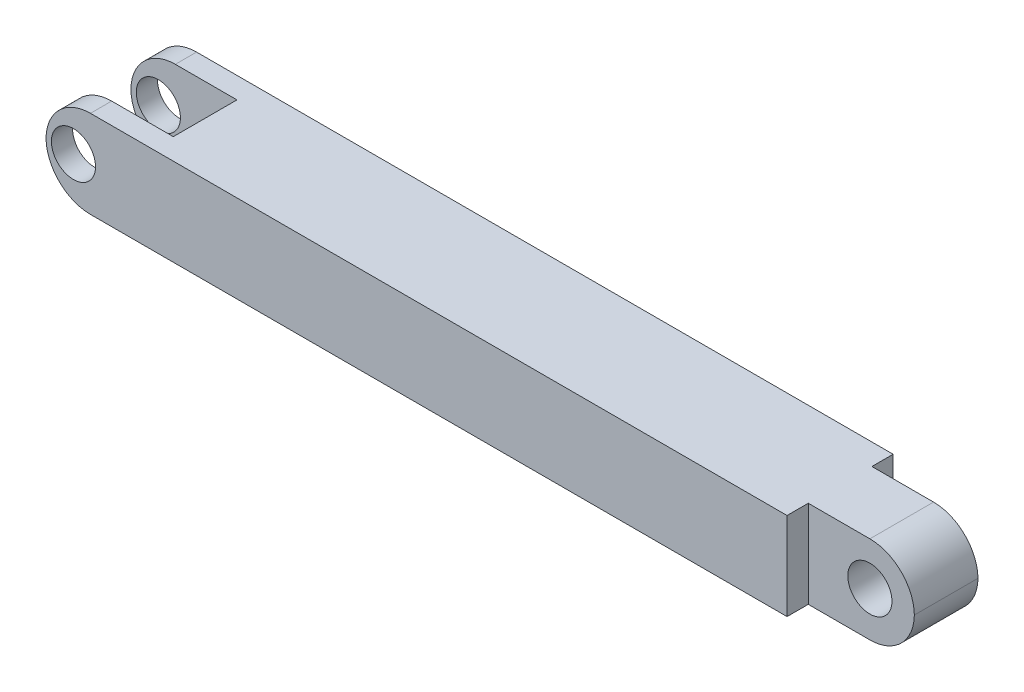
ISO-10303-21;
HEADER;
FILE_DESCRIPTION(('STEP AP214'),'2;1');
FILE_NAME('part.step','',(''),(''),'','','');
FILE_SCHEMA(('AUTOMOTIVE_DESIGN { 1 0 10303 214 1 1 1 1 }'));
ENDSEC;
DATA;
#1=APPLICATION_CONTEXT('core data for automotive mechanical design processes');
#2=APPLICATION_PROTOCOL_DEFINITION('international standard','automotive_design',2000,#1);
#3=PRODUCT_CONTEXT('',#1,'mechanical');
#4=PRODUCT('Part','Part','',(#3));
#5=PRODUCT_RELATED_PRODUCT_CATEGORY('part','',(#4));
#6=PRODUCT_DEFINITION_FORMATION('','',#4);
#7=PRODUCT_DEFINITION_CONTEXT('part definition',#1,'design');
#8=PRODUCT_DEFINITION('design','',#6,#7);
#9=PRODUCT_DEFINITION_SHAPE('','',#8);
#10=(LENGTH_UNIT() NAMED_UNIT(*) SI_UNIT(.MILLI.,.METRE.));
#11=(NAMED_UNIT(*) PLANE_ANGLE_UNIT() SI_UNIT($,.RADIAN.));
#12=(NAMED_UNIT(*) SI_UNIT($,.STERADIAN.) SOLID_ANGLE_UNIT());
#13=UNCERTAINTY_MEASURE_WITH_UNIT(LENGTH_MEASURE(1.E-05),#10,'distance_accuracy_value','');
#14=(GEOMETRIC_REPRESENTATION_CONTEXT(3) GLOBAL_UNCERTAINTY_ASSIGNED_CONTEXT((#13)) GLOBAL_UNIT_ASSIGNED_CONTEXT((#10,
#11,#12)) REPRESENTATION_CONTEXT('',''));
#15=CARTESIAN_POINT('',(0.,0.,0.));
#16=DIRECTION('',(0.,0.,1.));
#17=DIRECTION('',(1.,0.,0.));
#18=AXIS2_PLACEMENT_3D('',#15,#16,#17);
#19=CARTESIAN_POINT('',(69.85,8.255,0.));
#20=DIRECTION('',(1.,0.,0.));
#21=DIRECTION('',(0.,0.,-1.));
#22=AXIS2_PLACEMENT_3D('',#19,#20,#21);
#23=PLANE('',#22);
#24=DIRECTION('',(0.,0.,1.));
#25=VECTOR('',#24,1.);
#26=CARTESIAN_POINT('',(69.85,0.,0.));
#27=LINE('',#26,#25);
#28=CARTESIAN_POINT('',(69.85,0.,7.99998));
#29=VERTEX_POINT('',#28);
#30=CARTESIAN_POINT('',(69.85,0.,9.99998));
#31=VERTEX_POINT('',#30);
#32=EDGE_CURVE('E159',#29,#31,#27,.T.);
#33=ORIENTED_EDGE('',*,*,#32,.F.);
#34=DIRECTION('',(0.,-1.,0.));
#35=VECTOR('',#34,1.);
#36=CARTESIAN_POINT('',(69.85,8.255,7.99998));
#37=LINE('',#36,#35);
#38=CARTESIAN_POINT('',(69.85,8.255,7.99998));
#39=VERTEX_POINT('',#38);
#40=EDGE_CURVE('E147',#39,#29,#37,.T.);
#41=ORIENTED_EDGE('',*,*,#40,.F.);
#42=DIRECTION('',(0.,0.,1.));
#43=VECTOR('',#42,1.);
#44=CARTESIAN_POINT('',(69.85,8.255,0.));
#45=LINE('',#44,#43);
#46=CARTESIAN_POINT('',(69.85,8.255,9.99998));
#47=VERTEX_POINT('',#46);
#48=EDGE_CURVE('E153',#39,#47,#45,.T.);
#49=ORIENTED_EDGE('',*,*,#48,.T.);
#50=DIRECTION('',(0.,-1.,0.));
#51=VECTOR('',#50,1.);
#52=CARTESIAN_POINT('',(69.85,8.255,9.99998));
#53=LINE('',#52,#51);
#54=EDGE_CURVE('E189',#47,#31,#53,.T.);
#55=ORIENTED_EDGE('',*,*,#54,.T.);
#56=EDGE_LOOP('',(#33,#41,#49,#55));
#57=FACE_BOUND('',#56,.T.);
#58=ADVANCED_FACE('F35',(#57),#23,.T.);
#59=CARTESIAN_POINT('',(0.,8.255,7.99998000000001));
#60=DIRECTION('',(0.,0.,1.));
#61=DIRECTION('',(1.,0.,0.));
#62=AXIS2_PLACEMENT_3D('',#59,#60,#61);
#63=PLANE('',#62);
#64=CARTESIAN_POINT('',(75.65898,4.191,7.99998000000001));
#65=DIRECTION('',(0.,0.,1.));
#66=DIRECTION('',(1.,0.,0.));
#67=AXIS2_PLACEMENT_3D('',#64,#65,#66);
#68=CIRCLE('',#67,2.07899);
#69=CARTESIAN_POINT('',(77.73797,4.191,7.99998000000001));
#70=VERTEX_POINT('',#69);
#71=EDGE_CURVE('E265',#70,#70,#68,.T.);
#72=ORIENTED_EDGE('',*,*,#71,.F.);
#73=EDGE_LOOP('',(#72));
#74=FACE_BOUND('',#73,.T.);
#75=DIRECTION('',(-1.,0.,0.));
#76=VECTOR('',#75,1.);
#77=CARTESIAN_POINT('',(0.,0.,7.99998000000001));
#78=LINE('',#77,#76);
#79=CARTESIAN_POINT('',(75.65898,0.,7.99998));
#80=VERTEX_POINT('',#79);
#81=EDGE_CURVE('E191',#80,#29,#78,.T.);
#82=ORIENTED_EDGE('',*,*,#81,.F.);
#83=CARTESIAN_POINT('',(75.65898,4.191,7.99998));
#84=DIRECTION('',(0.,0.,1.));
#85=DIRECTION('',(1.,0.,0.));
#86=AXIS2_PLACEMENT_3D('',#83,#84,#85);
#87=CIRCLE('',#86,4.191);
#88=CARTESIAN_POINT('',(79.8494989117817,4.1275,7.99998));
#89=VERTEX_POINT('',#88);
#90=EDGE_CURVE('E253',#80,#89,#87,.T.);
#91=ORIENTED_EDGE('',*,*,#90,.T.);
#92=CARTESIAN_POINT('',(75.65898,4.064,7.99998));
#93=DIRECTION('',(0.,0.,1.));
#94=DIRECTION('',(1.,0.,0.));
#95=AXIS2_PLACEMENT_3D('',#92,#93,#94);
#96=CIRCLE('',#95,4.191);
#97=CARTESIAN_POINT('',(75.65898,8.255,7.99998));
#98=VERTEX_POINT('',#97);
#99=EDGE_CURVE('E150',#89,#98,#96,.T.);
#100=ORIENTED_EDGE('',*,*,#99,.T.);
#101=DIRECTION('',(-1.,0.,0.));
#102=VECTOR('',#101,1.);
#103=CARTESIAN_POINT('',(0.,8.255,7.99998000000001));
#104=LINE('',#103,#102);
#105=EDGE_CURVE('E143',#98,#39,#104,.T.);
#106=ORIENTED_EDGE('',*,*,#105,.T.);
#107=ORIENTED_EDGE('',*,*,#40,.T.);
#108=EDGE_LOOP('',(#82,#91,#100,#106,#107));
#109=FACE_BOUND('',#108,.T.);
#110=ADVANCED_FACE('F146',(#74,#109),#63,.T.);
#111=CARTESIAN_POINT('',(0.,8.255,2.));
#112=DIRECTION('',(0.,0.,-1.));
#113=DIRECTION('',(-1.,0.,0.));
#114=AXIS2_PLACEMENT_3D('',#111,#112,#113);
#115=PLANE('',#114);
#116=CARTESIAN_POINT('',(75.65898,4.191,2.));
#117=DIRECTION('',(0.,0.,-1.));
#118=DIRECTION('',(-1.,0.,0.));
#119=AXIS2_PLACEMENT_3D('',#116,#117,#118);
#120=CIRCLE('',#119,2.07899);
#121=CARTESIAN_POINT('',(73.57999,4.191,2.));
#122=VERTEX_POINT('',#121);
#123=EDGE_CURVE('E39',#122,#122,#120,.T.);
#124=ORIENTED_EDGE('',*,*,#123,.F.);
#125=EDGE_LOOP('',(#124));
#126=FACE_BOUND('',#125,.T.);
#127=CARTESIAN_POINT('',(75.65898,4.064,2.));
#128=DIRECTION('',(0.,0.,-1.));
#129=DIRECTION('',(-1.,0.,0.));
#130=AXIS2_PLACEMENT_3D('',#127,#128,#129);
#131=CIRCLE('',#130,4.191);
#132=CARTESIAN_POINT('',(75.65898,8.255,2.));
#133=VERTEX_POINT('',#132);
#134=CARTESIAN_POINT('',(79.8494989117817,4.1275,2.));
#135=VERTEX_POINT('',#134);
#136=EDGE_CURVE('E52',#133,#135,#131,.T.);
#137=ORIENTED_EDGE('',*,*,#136,.T.);
#138=CARTESIAN_POINT('',(75.65898,4.191,2.));
#139=DIRECTION('',(0.,0.,-1.));
#140=DIRECTION('',(-1.,0.,0.));
#141=AXIS2_PLACEMENT_3D('',#138,#139,#140);
#142=CIRCLE('',#141,4.191);
#143=CARTESIAN_POINT('',(75.65898,0.,2.));
#144=VERTEX_POINT('',#143);
#145=EDGE_CURVE('E44',#135,#144,#142,.T.);
#146=ORIENTED_EDGE('',*,*,#145,.T.);
#147=DIRECTION('',(1.,0.,0.));
#148=VECTOR('',#147,1.);
#149=CARTESIAN_POINT('',(0.,0.,2.));
#150=LINE('',#149,#148);
#151=CARTESIAN_POINT('',(69.85,0.,2.));
#152=VERTEX_POINT('',#151);
#153=EDGE_CURVE('E194',#152,#144,#150,.T.);
#154=ORIENTED_EDGE('',*,*,#153,.F.);
#155=DIRECTION('',(0.,-1.,0.));
#156=VECTOR('',#155,1.);
#157=CARTESIAN_POINT('',(69.85,8.255,2.));
#158=LINE('',#157,#156);
#159=CARTESIAN_POINT('',(69.85,8.255,2.));
#160=VERTEX_POINT('',#159);
#161=EDGE_CURVE('E161',#160,#152,#158,.T.);
#162=ORIENTED_EDGE('',*,*,#161,.F.);
#163=DIRECTION('',(1.,0.,0.));
#164=VECTOR('',#163,1.);
#165=CARTESIAN_POINT('',(0.,8.255,2.));
#166=LINE('',#165,#164);
#167=EDGE_CURVE('E152',#160,#133,#166,.T.);
#168=ORIENTED_EDGE('',*,*,#167,.T.);
#169=EDGE_LOOP('',(#137,#146,#154,#162,#168));
#170=FACE_BOUND('',#169,.T.);
#171=ADVANCED_FACE('F304',(#126,#170),#115,.T.);
#172=CARTESIAN_POINT('',(69.85,8.255,0.));
#173=DIRECTION('',(1.,0.,0.));
#174=DIRECTION('',(0.,0.,-1.));
#175=AXIS2_PLACEMENT_3D('',#172,#173,#174);
#176=PLANE('',#175);
#177=DIRECTION('',(0.,0.,1.));
#178=VECTOR('',#177,1.);
#179=CARTESIAN_POINT('',(69.85,0.,0.));
#180=LINE('',#179,#178);
#181=CARTESIAN_POINT('',(69.85,0.,0.));
#182=VERTEX_POINT('',#181);
#183=EDGE_CURVE('E197',#182,#152,#180,.T.);
#184=ORIENTED_EDGE('',*,*,#183,.F.);
#185=DIRECTION('',(0.,-1.,0.));
#186=VECTOR('',#185,1.);
#187=CARTESIAN_POINT('',(69.85,8.255,0.));
#188=LINE('',#187,#186);
#189=CARTESIAN_POINT('',(69.85,8.255,0.));
#190=VERTEX_POINT('',#189);
#191=EDGE_CURVE('E215',#190,#182,#188,.T.);
#192=ORIENTED_EDGE('',*,*,#191,.F.);
#193=DIRECTION('',(0.,0.,1.));
#194=VECTOR('',#193,1.);
#195=CARTESIAN_POINT('',(69.85,8.255,0.));
#196=LINE('',#195,#194);
#197=EDGE_CURVE('E176',#190,#160,#196,.T.);
#198=ORIENTED_EDGE('',*,*,#197,.T.);
#199=ORIENTED_EDGE('',*,*,#161,.T.);
#200=EDGE_LOOP('',(#184,#192,#198,#199));
#201=FACE_BOUND('',#200,.T.);
#202=ADVANCED_FACE('F336',(#201),#176,.T.);
#203=CARTESIAN_POINT('',(0.,8.255,0.));
#204=DIRECTION('',(0.,0.,-1.));
#205=DIRECTION('',(-1.,0.,0.));
#206=AXIS2_PLACEMENT_3D('',#203,#204,#205);
#207=PLANE('',#206);
#208=CARTESIAN_POINT('',(2.58747108821831,4.1275,0.));
#209=DIRECTION('',(0.,0.,1.));
#210=DIRECTION('',(1.,0.,0.));
#211=AXIS2_PLACEMENT_3D('',#208,#209,#210);
#212=CIRCLE('',#211,2.07899);
#213=CARTESIAN_POINT('',(4.66646108821831,4.1275,0.));
#214=VERTEX_POINT('',#213);
#215=EDGE_CURVE('E262',#214,#214,#212,.T.);
#216=ORIENTED_EDGE('',*,*,#215,.T.);
#217=EDGE_LOOP('',(#216));
#218=FACE_BOUND('',#217,.T.);
#219=DIRECTION('',(1.,0.,0.));
#220=VECTOR('',#219,1.);
#221=CARTESIAN_POINT('',(0.,0.,0.));
#222=LINE('',#221,#220);
#223=CARTESIAN_POINT('',(4.191,0.,0.));
#224=VERTEX_POINT('',#223);
#225=EDGE_CURVE('E200',#224,#182,#222,.T.);
#226=ORIENTED_EDGE('',*,*,#225,.F.);
#227=CARTESIAN_POINT('',(4.191,4.191,0.));
#228=DIRECTION('',(0.,0.,-1.));
#229=DIRECTION('',(-1.,0.,0.));
#230=AXIS2_PLACEMENT_3D('',#227,#228,#229);
#231=CIRCLE('',#230,4.191);
#232=CARTESIAN_POINT('',(0.000481088218309486,4.1275,0.));
#233=VERTEX_POINT('',#232);
#234=EDGE_CURVE('E230',#224,#233,#231,.T.);
#235=ORIENTED_EDGE('',*,*,#234,.T.);
#236=CARTESIAN_POINT('',(4.191,4.064,0.));
#237=DIRECTION('',(0.,0.,-1.));
#238=DIRECTION('',(-1.,0.,0.));
#239=AXIS2_PLACEMENT_3D('',#236,#237,#238);
#240=CIRCLE('',#239,4.191);
#241=CARTESIAN_POINT('',(4.191,8.255,0.));
#242=VERTEX_POINT('',#241);
#243=EDGE_CURVE('E228',#233,#242,#240,.T.);
#244=ORIENTED_EDGE('',*,*,#243,.T.);
#245=DIRECTION('',(1.,0.,0.));
#246=VECTOR('',#245,1.);
#247=CARTESIAN_POINT('',(0.,8.255,0.));
#248=LINE('',#247,#246);
#249=EDGE_CURVE('E179',#242,#190,#248,.T.);
#250=ORIENTED_EDGE('',*,*,#249,.T.);
#251=ORIENTED_EDGE('',*,*,#191,.T.);
#252=EDGE_LOOP('',(#226,#235,#244,#250,#251));
#253=FACE_BOUND('',#252,.T.);
#254=ADVANCED_FACE('F367',(#218,#253),#207,.T.);
#255=CARTESIAN_POINT('',(0.,8.255,1.99898));
#256=DIRECTION('',(0.,0.,-1.));
#257=DIRECTION('',(-1.,0.,0.));
#258=AXIS2_PLACEMENT_3D('',#255,#256,#257);
#259=PLANE('',#258);
#260=CARTESIAN_POINT('',(2.58747108821831,4.1275,1.99898));
#261=DIRECTION('',(0.,0.,-1.));
#262=DIRECTION('',(-1.,0.,0.));
#263=AXIS2_PLACEMENT_3D('',#260,#261,#262);
#264=CIRCLE('',#263,2.07899);
#265=CARTESIAN_POINT('',(0.508481088218311,4.1275,1.99898));
#266=VERTEX_POINT('',#265);
#267=EDGE_CURVE('E172',#266,#266,#264,.T.);
#268=ORIENTED_EDGE('',*,*,#267,.T.);
#269=EDGE_LOOP('',(#268));
#270=FACE_BOUND('',#269,.T.);
#271=CARTESIAN_POINT('',(4.191,4.064,1.99898));
#272=DIRECTION('',(0.,0.,-1.));
#273=DIRECTION('',(-1.,0.,0.));
#274=AXIS2_PLACEMENT_3D('',#271,#272,#273);
#275=CIRCLE('',#274,4.191);
#276=CARTESIAN_POINT('',(4.191,8.255,1.99898));
#277=VERTEX_POINT('',#276);
#278=CARTESIAN_POINT('',(0.000481088218309486,4.1275,1.99898));
#279=VERTEX_POINT('',#278);
#280=EDGE_CURVE('E160',#277,#279,#275,.F.);
#281=ORIENTED_EDGE('',*,*,#280,.T.);
#282=CARTESIAN_POINT('',(4.191,4.191,1.99898));
#283=DIRECTION('',(0.,0.,-1.));
#284=DIRECTION('',(-1.,0.,0.));
#285=AXIS2_PLACEMENT_3D('',#282,#283,#284);
#286=CIRCLE('',#285,4.191);
#287=CARTESIAN_POINT('',(4.191,0.,1.99898));
#288=VERTEX_POINT('',#287);
#289=EDGE_CURVE('E220',#279,#288,#286,.F.);
#290=ORIENTED_EDGE('',*,*,#289,.T.);
#291=DIRECTION('',(1.,0.,0.));
#292=VECTOR('',#291,1.);
#293=CARTESIAN_POINT('',(0.,0.,1.99898));
#294=LINE('',#293,#292);
#295=CARTESIAN_POINT('',(9.99998,0.,1.99898));
#296=VERTEX_POINT('',#295);
#297=EDGE_CURVE('E202',#288,#296,#294,.T.);
#298=ORIENTED_EDGE('',*,*,#297,.T.);
#299=DIRECTION('',(0.,-1.,0.));
#300=VECTOR('',#299,1.);
#301=CARTESIAN_POINT('',(9.99998,8.255,1.99898));
#302=LINE('',#301,#300);
#303=CARTESIAN_POINT('',(9.99998,8.255,1.99898));
#304=VERTEX_POINT('',#303);
#305=EDGE_CURVE('E212',#304,#296,#302,.T.);
#306=ORIENTED_EDGE('',*,*,#305,.F.);
#307=DIRECTION('',(1.,0.,0.));
#308=VECTOR('',#307,1.);
#309=CARTESIAN_POINT('',(0.,8.255,1.99898));
#310=LINE('',#309,#308);
#311=EDGE_CURVE('E181',#277,#304,#310,.T.);
#312=ORIENTED_EDGE('',*,*,#311,.F.);
#313=EDGE_LOOP('',(#281,#290,#298,#306,#312));
#314=FACE_BOUND('',#313,.T.);
#315=ADVANCED_FACE('F281',(#270,#314),#259,.F.);
#316=CARTESIAN_POINT('',(9.99998,8.255,0.));
#317=DIRECTION('',(-1.,0.,0.));
#318=DIRECTION('',(0.,0.,1.));
#319=AXIS2_PLACEMENT_3D('',#316,#317,#318);
#320=PLANE('',#319);
#321=DIRECTION('',(0.,0.,-1.));
#322=VECTOR('',#321,1.);
#323=CARTESIAN_POINT('',(9.99998,0.,0.));
#324=LINE('',#323,#322);
#325=CARTESIAN_POINT('',(9.99998,0.,8.001));
#326=VERTEX_POINT('',#325);
#327=EDGE_CURVE('E204',#326,#296,#324,.T.);
#328=ORIENTED_EDGE('',*,*,#327,.F.);
#329=DIRECTION('',(0.,-1.,0.));
#330=VECTOR('',#329,1.);
#331=CARTESIAN_POINT('',(9.99998,8.255,8.001));
#332=LINE('',#331,#330);
#333=CARTESIAN_POINT('',(9.99998,8.255,8.001));
#334=VERTEX_POINT('',#333);
#335=EDGE_CURVE('E209',#334,#326,#332,.T.);
#336=ORIENTED_EDGE('',*,*,#335,.F.);
#337=DIRECTION('',(0.,0.,-1.));
#338=VECTOR('',#337,1.);
#339=CARTESIAN_POINT('',(9.99998,8.255,0.));
#340=LINE('',#339,#338);
#341=EDGE_CURVE('E183',#334,#304,#340,.T.);
#342=ORIENTED_EDGE('',*,*,#341,.T.);
#343=ORIENTED_EDGE('',*,*,#305,.T.);
#344=EDGE_LOOP('',(#328,#336,#342,#343));
#345=FACE_BOUND('',#344,.T.);
#346=ADVANCED_FACE('F354',(#345),#320,.T.);
#347=CARTESIAN_POINT('',(0.,8.255,8.001));
#348=DIRECTION('',(0.,0.,-1.));
#349=DIRECTION('',(-1.,0.,0.));
#350=AXIS2_PLACEMENT_3D('',#347,#348,#349);
#351=PLANE('',#350);
#352=CARTESIAN_POINT('',(2.58747108821831,4.1275,8.001));
#353=DIRECTION('',(0.,0.,-1.));
#354=DIRECTION('',(-1.,0.,0.));
#355=AXIS2_PLACEMENT_3D('',#352,#353,#354);
#356=CIRCLE('',#355,2.07899);
#357=CARTESIAN_POINT('',(0.508481088218311,4.1275,8.001));
#358=VERTEX_POINT('',#357);
#359=EDGE_CURVE('E274',#358,#358,#356,.T.);
#360=ORIENTED_EDGE('',*,*,#359,.F.);
#361=EDGE_LOOP('',(#360));
#362=FACE_BOUND('',#361,.T.);
#363=DIRECTION('',(1.,0.,0.));
#364=VECTOR('',#363,1.);
#365=CARTESIAN_POINT('',(0.,0.,8.001));
#366=LINE('',#365,#364);
#367=CARTESIAN_POINT('',(4.191,0.,8.001));
#368=VERTEX_POINT('',#367);
#369=EDGE_CURVE('E169',#368,#326,#366,.T.);
#370=ORIENTED_EDGE('',*,*,#369,.F.);
#371=CARTESIAN_POINT('',(4.191,4.191,8.001));
#372=DIRECTION('',(0.,0.,-1.));
#373=DIRECTION('',(-1.,0.,0.));
#374=AXIS2_PLACEMENT_3D('',#371,#372,#373);
#375=CIRCLE('',#374,4.191);
#376=CARTESIAN_POINT('',(0.000481088218310353,4.1275,8.001));
#377=VERTEX_POINT('',#376);
#378=EDGE_CURVE('E234',#368,#377,#375,.T.);
#379=ORIENTED_EDGE('',*,*,#378,.T.);
#380=CARTESIAN_POINT('',(4.191,4.064,8.001));
#381=DIRECTION('',(0.,0.,-1.));
#382=DIRECTION('',(-1.,0.,0.));
#383=AXIS2_PLACEMENT_3D('',#380,#381,#382);
#384=CIRCLE('',#383,4.191);
#385=CARTESIAN_POINT('',(4.191,8.255,8.001));
#386=VERTEX_POINT('',#385);
#387=EDGE_CURVE('E232',#377,#386,#384,.T.);
#388=ORIENTED_EDGE('',*,*,#387,.T.);
#389=DIRECTION('',(1.,0.,0.));
#390=VECTOR('',#389,1.);
#391=CARTESIAN_POINT('',(0.,8.255,8.001));
#392=LINE('',#391,#390);
#393=EDGE_CURVE('E186',#386,#334,#392,.T.);
#394=ORIENTED_EDGE('',*,*,#393,.T.);
#395=ORIENTED_EDGE('',*,*,#335,.T.);
#396=EDGE_LOOP('',(#370,#379,#388,#394,#395));
#397=FACE_BOUND('',#396,.T.);
#398=ADVANCED_FACE('F357',(#362,#397),#351,.T.);
#399=CARTESIAN_POINT('',(0.,8.255,9.99998));
#400=DIRECTION('',(0.,0.,-1.));
#401=DIRECTION('',(-1.,0.,0.));
#402=AXIS2_PLACEMENT_3D('',#399,#400,#401);
#403=PLANE('',#402);
#404=CARTESIAN_POINT('',(2.58747108821831,4.1275,9.99998));
#405=DIRECTION('',(0.,0.,1.));
#406=DIRECTION('',(1.,0.,0.));
#407=AXIS2_PLACEMENT_3D('',#404,#405,#406);
#408=CIRCLE('',#407,2.07899);
#409=CARTESIAN_POINT('',(4.66646108821831,4.1275,9.99998));
#410=VERTEX_POINT('',#409);
#411=EDGE_CURVE('E258',#410,#410,#408,.T.);
#412=ORIENTED_EDGE('',*,*,#411,.F.);
#413=EDGE_LOOP('',(#412));
#414=FACE_BOUND('',#413,.T.);
#415=CARTESIAN_POINT('',(4.191,4.064,9.99998));
#416=DIRECTION('',(0.,0.,-1.));
#417=DIRECTION('',(-1.,0.,0.));
#418=AXIS2_PLACEMENT_3D('',#415,#416,#417);
#419=CIRCLE('',#418,4.191);
#420=CARTESIAN_POINT('',(4.191,8.255,9.99998));
#421=VERTEX_POINT('',#420);
#422=CARTESIAN_POINT('',(0.000481088218311221,4.1275,9.99998));
#423=VERTEX_POINT('',#422);
#424=EDGE_CURVE('E236',#421,#423,#419,.F.);
#425=ORIENTED_EDGE('',*,*,#424,.T.);
#426=CARTESIAN_POINT('',(4.191,4.191,9.99998));
#427=DIRECTION('',(0.,0.,-1.));
#428=DIRECTION('',(-1.,0.,0.));
#429=AXIS2_PLACEMENT_3D('',#426,#427,#428);
#430=CIRCLE('',#429,4.191);
#431=CARTESIAN_POINT('',(4.191,0.,9.99998));
#432=VERTEX_POINT('',#431);
#433=EDGE_CURVE('E238',#423,#432,#430,.F.);
#434=ORIENTED_EDGE('',*,*,#433,.T.);
#435=DIRECTION('',(1.,0.,0.));
#436=VECTOR('',#435,1.);
#437=CARTESIAN_POINT('',(0.,0.,9.99998));
#438=LINE('',#437,#436);
#439=EDGE_CURVE('E167',#432,#31,#438,.T.);
#440=ORIENTED_EDGE('',*,*,#439,.T.);
#441=ORIENTED_EDGE('',*,*,#54,.F.);
#442=DIRECTION('',(1.,0.,0.));
#443=VECTOR('',#442,1.);
#444=CARTESIAN_POINT('',(0.,8.255,9.99998));
#445=LINE('',#444,#443);
#446=EDGE_CURVE('E165',#421,#47,#445,.T.);
#447=ORIENTED_EDGE('',*,*,#446,.F.);
#448=EDGE_LOOP('',(#425,#434,#440,#441,#447));
#449=FACE_BOUND('',#448,.T.);
#450=ADVANCED_FACE('F365',(#414,#449),#403,.F.);
#451=CARTESIAN_POINT('',(0.,8.255,0.));
#452=DIRECTION('',(0.,1.,0.));
#453=DIRECTION('',(0.,0.,1.));
#454=AXIS2_PLACEMENT_3D('',#451,#452,#453);
#455=PLANE('',#454);
#456=ORIENTED_EDGE('',*,*,#105,.F.);
#457=DIRECTION('',(0.,0.,1.));
#458=VECTOR('',#457,1.);
#459=CARTESIAN_POINT('',(75.65898,8.255,0.));
#460=LINE('',#459,#458);
#461=EDGE_CURVE('E11',#98,#133,#460,.F.);
#462=ORIENTED_EDGE('',*,*,#461,.T.);
#463=ORIENTED_EDGE('',*,*,#167,.F.);
#464=ORIENTED_EDGE('',*,*,#197,.F.);
#465=ORIENTED_EDGE('',*,*,#249,.F.);
#466=DIRECTION('',(0.,0.,1.));
#467=VECTOR('',#466,1.);
#468=CARTESIAN_POINT('',(4.191,8.255,1.99898));
#469=LINE('',#468,#467);
#470=EDGE_CURVE('E242',#242,#277,#469,.T.);
#471=ORIENTED_EDGE('',*,*,#470,.T.);
#472=ORIENTED_EDGE('',*,*,#311,.T.);
#473=ORIENTED_EDGE('',*,*,#341,.F.);
#474=ORIENTED_EDGE('',*,*,#393,.F.);
#475=DIRECTION('',(0.,0.,-1.));
#476=VECTOR('',#475,1.);
#477=CARTESIAN_POINT('',(4.191,8.255,0.));
#478=LINE('',#477,#476);
#479=EDGE_CURVE('E240',#386,#421,#478,.F.);
#480=ORIENTED_EDGE('',*,*,#479,.T.);
#481=ORIENTED_EDGE('',*,*,#446,.T.);
#482=ORIENTED_EDGE('',*,*,#48,.F.);
#483=EDGE_LOOP('',(#456,#462,#463,#464,#465,#471,#472,#473,#474,#480,#481,#482));
#484=FACE_BOUND('',#483,.T.);
#485=ADVANCED_FACE('F163',(#484),#455,.T.);
#486=CARTESIAN_POINT('',(0.,0.,0.));
#487=DIRECTION('',(0.,1.,0.));
#488=DIRECTION('',(0.,0.,1.));
#489=AXIS2_PLACEMENT_3D('',#486,#487,#488);
#490=PLANE('',#489);
#491=ORIENTED_EDGE('',*,*,#153,.T.);
#492=DIRECTION('',(0.,0.,1.));
#493=VECTOR('',#492,1.);
#494=CARTESIAN_POINT('',(75.65898,0.,7.99998));
#495=LINE('',#494,#493);
#496=EDGE_CURVE('E244',#144,#80,#495,.T.);
#497=ORIENTED_EDGE('',*,*,#496,.T.);
#498=ORIENTED_EDGE('',*,*,#81,.T.);
#499=ORIENTED_EDGE('',*,*,#32,.T.);
#500=ORIENTED_EDGE('',*,*,#439,.F.);
#501=DIRECTION('',(0.,0.,-1.));
#502=VECTOR('',#501,1.);
#503=CARTESIAN_POINT('',(4.191,0.,8.001));
#504=LINE('',#503,#502);
#505=EDGE_CURVE('E222',#432,#368,#504,.T.);
#506=ORIENTED_EDGE('',*,*,#505,.T.);
#507=ORIENTED_EDGE('',*,*,#369,.T.);
#508=ORIENTED_EDGE('',*,*,#327,.T.);
#509=ORIENTED_EDGE('',*,*,#297,.F.);
#510=DIRECTION('',(0.,0.,1.));
#511=VECTOR('',#510,1.);
#512=CARTESIAN_POINT('',(4.191,0.,0.));
#513=LINE('',#512,#511);
#514=EDGE_CURVE('E225',#288,#224,#513,.F.);
#515=ORIENTED_EDGE('',*,*,#514,.T.);
#516=ORIENTED_EDGE('',*,*,#225,.T.);
#517=ORIENTED_EDGE('',*,*,#183,.T.);
#518=EDGE_LOOP('',(#491,#497,#498,#499,#500,#506,#507,#508,#509,#515,#516,#517));
#519=FACE_BOUND('',#518,.T.);
#520=ADVANCED_FACE('F317',(#519),#490,.F.);
#521=CARTESIAN_POINT('',(4.191,4.064,0.));
#522=DIRECTION('',(0.,0.,-1.));
#523=DIRECTION('',(-1.,0.,0.));
#524=AXIS2_PLACEMENT_3D('',#521,#522,#523);
#525=CYLINDRICAL_SURFACE('',#524,4.191);
#526=ORIENTED_EDGE('',*,*,#470,.F.);
#527=ORIENTED_EDGE('',*,*,#243,.F.);
#528=DIRECTION('',(0.,0.,-1.));
#529=VECTOR('',#528,1.);
#530=CARTESIAN_POINT('',(0.000481088218309486,4.1275,0.99949));
#531=LINE('',#530,#529);
#532=EDGE_CURVE('E192',#279,#233,#531,.T.);
#533=ORIENTED_EDGE('',*,*,#532,.F.);
#534=ORIENTED_EDGE('',*,*,#280,.F.);
#535=EDGE_LOOP('',(#526,#527,#533,#534));
#536=FACE_BOUND('',#535,.T.);
#537=ADVANCED_FACE('F313',(#536),#525,.T.);
#538=CARTESIAN_POINT('',(4.191,4.191,0.));
#539=DIRECTION('',(0.,0.,1.));
#540=DIRECTION('',(1.,0.,0.));
#541=AXIS2_PLACEMENT_3D('',#538,#539,#540);
#542=CYLINDRICAL_SURFACE('',#541,4.191);
#543=ORIENTED_EDGE('',*,*,#234,.F.);
#544=ORIENTED_EDGE('',*,*,#514,.F.);
#545=ORIENTED_EDGE('',*,*,#289,.F.);
#546=ORIENTED_EDGE('',*,*,#532,.T.);
#547=EDGE_LOOP('',(#543,#544,#545,#546));
#548=FACE_BOUND('',#547,.T.);
#549=ADVANCED_FACE('F309',(#548),#542,.T.);
#550=CARTESIAN_POINT('',(4.191,4.064,0.));
#551=DIRECTION('',(0.,0.,-1.));
#552=DIRECTION('',(-1.,0.,0.));
#553=AXIS2_PLACEMENT_3D('',#550,#551,#552);
#554=CYLINDRICAL_SURFACE('',#553,4.191);
#555=DIRECTION('',(0.,0.,-1.));
#556=VECTOR('',#555,1.);
#557=CARTESIAN_POINT('',(0.000481088218311221,4.1275,9.00049));
#558=LINE('',#557,#556);
#559=EDGE_CURVE('E247',#423,#377,#558,.T.);
#560=ORIENTED_EDGE('',*,*,#559,.F.);
#561=ORIENTED_EDGE('',*,*,#424,.F.);
#562=ORIENTED_EDGE('',*,*,#479,.F.);
#563=ORIENTED_EDGE('',*,*,#387,.F.);
#564=EDGE_LOOP('',(#560,#561,#562,#563));
#565=FACE_BOUND('',#564,.T.);
#566=ADVANCED_FACE('F312',(#565),#554,.T.);
#567=CARTESIAN_POINT('',(4.191,4.191,0.));
#568=DIRECTION('',(0.,0.,1.));
#569=DIRECTION('',(1.,0.,0.));
#570=AXIS2_PLACEMENT_3D('',#567,#568,#569);
#571=CYLINDRICAL_SURFACE('',#570,4.191);
#572=ORIENTED_EDGE('',*,*,#433,.F.);
#573=ORIENTED_EDGE('',*,*,#559,.T.);
#574=ORIENTED_EDGE('',*,*,#378,.F.);
#575=ORIENTED_EDGE('',*,*,#505,.F.);
#576=EDGE_LOOP('',(#572,#573,#574,#575));
#577=FACE_BOUND('',#576,.T.);
#578=ADVANCED_FACE('F295',(#577),#571,.T.);
#579=CARTESIAN_POINT('',(2.58747108821831,4.1275,0.));
#580=DIRECTION('',(0.,0.,1.));
#581=DIRECTION('',(1.,0.,0.));
#582=AXIS2_PLACEMENT_3D('',#579,#580,#581);
#583=CYLINDRICAL_SURFACE('',#582,2.07899);
#584=ORIENTED_EDGE('',*,*,#359,.T.);
#585=EDGE_LOOP('',(#584));
#586=FACE_BOUND('',#585,.T.);
#587=ORIENTED_EDGE('',*,*,#411,.T.);
#588=EDGE_LOOP('',(#587));
#589=FACE_BOUND('',#588,.T.);
#590=ADVANCED_FACE('F286',(#586,#589),#583,.F.);
#591=ORIENTED_EDGE('',*,*,#215,.F.);
#592=EDGE_LOOP('',(#591));
#593=FACE_BOUND('',#592,.T.);
#594=ORIENTED_EDGE('',*,*,#267,.F.);
#595=EDGE_LOOP('',(#594));
#596=FACE_BOUND('',#595,.T.);
#597=ADVANCED_FACE('F284',(#593,#596),#583,.F.);
#598=CARTESIAN_POINT('',(75.65898,4.064,0.));
#599=DIRECTION('',(0.,0.,1.));
#600=DIRECTION('',(1.,0.,0.));
#601=AXIS2_PLACEMENT_3D('',#598,#599,#600);
#602=CYLINDRICAL_SURFACE('',#601,4.191);
#603=DIRECTION('',(0.,0.,1.));
#604=VECTOR('',#603,1.);
#605=CARTESIAN_POINT('',(79.8494989117817,4.1275,4.99999));
#606=LINE('',#605,#604);
#607=EDGE_CURVE('E256',#135,#89,#606,.T.);
#608=ORIENTED_EDGE('',*,*,#607,.F.);
#609=ORIENTED_EDGE('',*,*,#136,.F.);
#610=ORIENTED_EDGE('',*,*,#461,.F.);
#611=ORIENTED_EDGE('',*,*,#99,.F.);
#612=EDGE_LOOP('',(#608,#609,#610,#611));
#613=FACE_BOUND('',#612,.T.);
#614=ADVANCED_FACE('F37',(#613),#602,.T.);
#615=CARTESIAN_POINT('',(75.65898,4.191,0.));
#616=DIRECTION('',(0.,0.,-1.));
#617=DIRECTION('',(-1.,0.,0.));
#618=AXIS2_PLACEMENT_3D('',#615,#616,#617);
#619=CYLINDRICAL_SURFACE('',#618,4.191);
#620=ORIENTED_EDGE('',*,*,#145,.F.);
#621=ORIENTED_EDGE('',*,*,#607,.T.);
#622=ORIENTED_EDGE('',*,*,#90,.F.);
#623=ORIENTED_EDGE('',*,*,#496,.F.);
#624=EDGE_LOOP('',(#620,#621,#622,#623));
#625=FACE_BOUND('',#624,.T.);
#626=ADVANCED_FACE('F293',(#625),#619,.T.);
#627=CARTESIAN_POINT('',(75.65898,4.191,-0.255019999999988));
#628=DIRECTION('',(0.,0.,1.));
#629=DIRECTION('',(1.,0.,0.));
#630=AXIS2_PLACEMENT_3D('',#627,#628,#629);
#631=CYLINDRICAL_SURFACE('',#630,2.07899);
#632=ORIENTED_EDGE('',*,*,#123,.T.);
#633=EDGE_LOOP('',(#632));
#634=FACE_BOUND('',#633,.T.);
#635=ORIENTED_EDGE('',*,*,#71,.T.);
#636=EDGE_LOOP('',(#635));
#637=FACE_BOUND('',#636,.T.);
#638=ADVANCED_FACE('F325',(#634,#637),#631,.F.);
#639=CLOSED_SHELL('',(#58,#110,#171,#202,#254,#315,#346,#398,#450,#485,#520,#537,#549,#566,#578,
#590,#597,#614,#626,#638));
#640=MANIFOLD_SOLID_BREP('B2',#639);
#641=ADVANCED_BREP_SHAPE_REPRESENTATION('',(#18,#640),#14);
#642=SHAPE_DEFINITION_REPRESENTATION(#9,#641);
ENDSEC;
END-ISO-10303-21;
